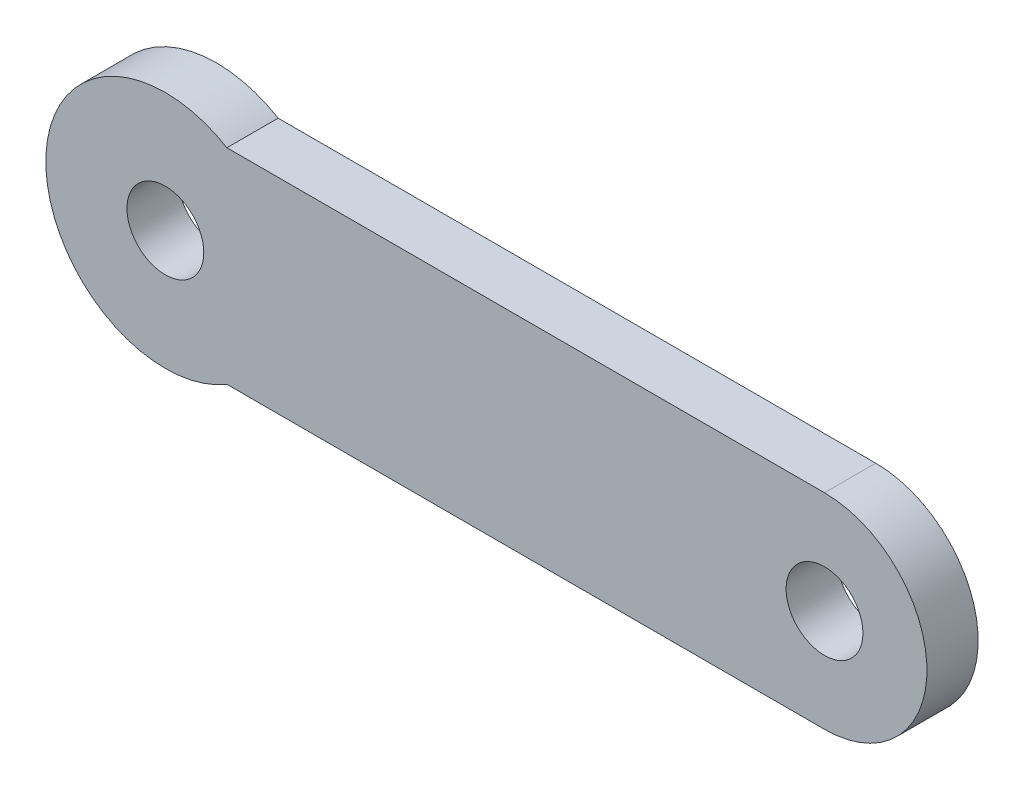
ISO-10303-21;
HEADER;
FILE_DESCRIPTION(('STEP AP214'),'2;1');
FILE_NAME('part.step','',(''),(''),'','','');
FILE_SCHEMA(('AUTOMOTIVE_DESIGN { 1 0 10303 214 1 1 1 1 }'));
ENDSEC;
DATA;
#1=APPLICATION_CONTEXT('core data for automotive mechanical design processes');
#2=APPLICATION_PROTOCOL_DEFINITION('international standard','automotive_design',2000,#1);
#3=PRODUCT_CONTEXT('',#1,'mechanical');
#4=PRODUCT('Part','Part','',(#3));
#5=PRODUCT_RELATED_PRODUCT_CATEGORY('part','',(#4));
#6=PRODUCT_DEFINITION_FORMATION('','',#4);
#7=PRODUCT_DEFINITION_CONTEXT('part definition',#1,'design');
#8=PRODUCT_DEFINITION('design','',#6,#7);
#9=PRODUCT_DEFINITION_SHAPE('','',#8);
#10=(LENGTH_UNIT() NAMED_UNIT(*) SI_UNIT(.MILLI.,.METRE.));
#11=(NAMED_UNIT(*) PLANE_ANGLE_UNIT() SI_UNIT($,.RADIAN.));
#12=(NAMED_UNIT(*) SI_UNIT($,.STERADIAN.) SOLID_ANGLE_UNIT());
#13=UNCERTAINTY_MEASURE_WITH_UNIT(LENGTH_MEASURE(1.E-05),#10,'distance_accuracy_value','');
#14=(GEOMETRIC_REPRESENTATION_CONTEXT(3) GLOBAL_UNCERTAINTY_ASSIGNED_CONTEXT((#13)) GLOBAL_UNIT_ASSIGNED_CONTEXT((#10,
#11,#12)) REPRESENTATION_CONTEXT('',''));
#15=CARTESIAN_POINT('',(0.,0.,0.));
#16=DIRECTION('',(0.,0.,1.));
#17=DIRECTION('',(1.,0.,0.));
#18=AXIS2_PLACEMENT_3D('',#15,#16,#17);
#19=CARTESIAN_POINT('',(0.,0.,3.));
#20=DIRECTION('',(0.,0.,1.));
#21=DIRECTION('',(1.,0.,0.));
#22=AXIS2_PLACEMENT_3D('',#19,#20,#21);
#23=PLANE('',#22);
#24=CARTESIAN_POINT('',(0.,0.,3.));
#25=DIRECTION('',(0.,0.,1.));
#26=DIRECTION('',(1.,0.,0.));
#27=AXIS2_PLACEMENT_3D('',#24,#25,#26);
#28=CIRCLE('',#27,2.25);
#29=CARTESIAN_POINT('',(2.25,0.,3.));
#30=VERTEX_POINT('',#29);
#31=EDGE_CURVE('E110',#30,#30,#28,.T.);
#32=ORIENTED_EDGE('',*,*,#31,.F.);
#33=EDGE_LOOP('',(#32));
#34=FACE_BOUND('',#33,.T.);
#35=CARTESIAN_POINT('',(0.,0.,3.));
#36=DIRECTION('',(0.,0.,1.));
#37=DIRECTION('',(1.,0.,0.));
#38=AXIS2_PLACEMENT_3D('',#35,#36,#37);
#39=CIRCLE('',#38,7.);
#40=CARTESIAN_POINT('',(3.60555127546399,6.,3.));
#41=VERTEX_POINT('',#40);
#42=CARTESIAN_POINT('',(3.60555127546399,-6.,3.));
#43=VERTEX_POINT('',#42);
#44=EDGE_CURVE('E95',#41,#43,#39,.T.);
#45=ORIENTED_EDGE('',*,*,#44,.T.);
#46=DIRECTION('',(1.,0.,0.));
#47=VECTOR('',#46,1.);
#48=CARTESIAN_POINT('',(3.60555127546399,-6.,3.));
#49=LINE('',#48,#47);
#50=CARTESIAN_POINT('',(38.605551275464,-6.,3.));
#51=VERTEX_POINT('',#50);
#52=EDGE_CURVE('E90',#43,#51,#49,.T.);
#53=ORIENTED_EDGE('',*,*,#52,.T.);
#54=CARTESIAN_POINT('',(38.605551275464,0.,3.));
#55=DIRECTION('',(0.,0.,1.));
#56=DIRECTION('',(-1.,0.,0.));
#57=AXIS2_PLACEMENT_3D('',#54,#55,#56);
#58=CIRCLE('',#57,6.);
#59=CARTESIAN_POINT('',(38.605551275464,6.,3.));
#60=VERTEX_POINT('',#59);
#61=EDGE_CURVE('E93',#51,#60,#58,.T.);
#62=ORIENTED_EDGE('',*,*,#61,.T.);
#63=DIRECTION('',(-1.,0.,0.));
#64=VECTOR('',#63,1.);
#65=CARTESIAN_POINT('',(3.60555127546399,6.,3.));
#66=LINE('',#65,#64);
#67=EDGE_CURVE('E60',#60,#41,#66,.T.);
#68=ORIENTED_EDGE('',*,*,#67,.T.);
#69=EDGE_LOOP('',(#45,#53,#62,#68));
#70=FACE_BOUND('',#69,.T.);
#71=CARTESIAN_POINT('',(38.605551275464,0.,3.));
#72=DIRECTION('',(0.,0.,1.));
#73=DIRECTION('',(1.,0.,0.));
#74=AXIS2_PLACEMENT_3D('',#71,#72,#73);
#75=CIRCLE('',#74,2.25);
#76=CARTESIAN_POINT('',(40.855551275464,0.,3.));
#77=VERTEX_POINT('',#76);
#78=EDGE_CURVE('E125',#77,#77,#75,.T.);
#79=ORIENTED_EDGE('',*,*,#78,.F.);
#80=EDGE_LOOP('',(#79));
#81=FACE_BOUND('',#80,.T.);
#82=ADVANCED_FACE('F43',(#34,#70,#81),#23,.T.);
#83=CARTESIAN_POINT('',(0.,0.,0.));
#84=DIRECTION('',(0.,0.,1.));
#85=DIRECTION('',(1.,0.,0.));
#86=AXIS2_PLACEMENT_3D('',#83,#84,#85);
#87=PLANE('',#86);
#88=CARTESIAN_POINT('',(0.,0.,0.));
#89=DIRECTION('',(0.,0.,1.));
#90=DIRECTION('',(1.,0.,0.));
#91=AXIS2_PLACEMENT_3D('',#88,#89,#90);
#92=CIRCLE('',#91,7.);
#93=CARTESIAN_POINT('',(3.60555127546399,6.,0.));
#94=VERTEX_POINT('',#93);
#95=CARTESIAN_POINT('',(3.60555127546399,-6.,0.));
#96=VERTEX_POINT('',#95);
#97=EDGE_CURVE('E107',#94,#96,#92,.T.);
#98=ORIENTED_EDGE('',*,*,#97,.F.);
#99=DIRECTION('',(-1.,0.,0.));
#100=VECTOR('',#99,1.);
#101=CARTESIAN_POINT('',(3.60555127546399,6.,0.));
#102=LINE('',#101,#100);
#103=CARTESIAN_POINT('',(38.605551275464,6.,0.));
#104=VERTEX_POINT('',#103);
#105=EDGE_CURVE('E83',#104,#94,#102,.T.);
#106=ORIENTED_EDGE('',*,*,#105,.F.);
#107=CARTESIAN_POINT('',(38.605551275464,0.,0.));
#108=DIRECTION('',(0.,0.,1.));
#109=DIRECTION('',(-1.,0.,0.));
#110=AXIS2_PLACEMENT_3D('',#107,#108,#109);
#111=CIRCLE('',#110,6.);
#112=CARTESIAN_POINT('',(38.605551275464,-6.,0.));
#113=VERTEX_POINT('',#112);
#114=EDGE_CURVE('E77',#113,#104,#111,.T.);
#115=ORIENTED_EDGE('',*,*,#114,.F.);
#116=DIRECTION('',(1.,0.,0.));
#117=VECTOR('',#116,1.);
#118=CARTESIAN_POINT('',(3.60555127546399,-6.,0.));
#119=LINE('',#118,#117);
#120=EDGE_CURVE('E99',#96,#113,#119,.T.);
#121=ORIENTED_EDGE('',*,*,#120,.F.);
#122=EDGE_LOOP('',(#98,#106,#115,#121));
#123=FACE_BOUND('',#122,.T.);
#124=CARTESIAN_POINT('',(0.,0.,0.));
#125=DIRECTION('',(0.,0.,1.));
#126=DIRECTION('',(1.,0.,0.));
#127=AXIS2_PLACEMENT_3D('',#124,#125,#126);
#128=CIRCLE('',#127,2.25);
#129=CARTESIAN_POINT('',(2.25,0.,0.));
#130=VERTEX_POINT('',#129);
#131=EDGE_CURVE('E122',#130,#130,#128,.T.);
#132=ORIENTED_EDGE('',*,*,#131,.T.);
#133=EDGE_LOOP('',(#132));
#134=FACE_BOUND('',#133,.T.);
#135=CARTESIAN_POINT('',(38.605551275464,0.,0.));
#136=DIRECTION('',(0.,0.,1.));
#137=DIRECTION('',(1.,0.,0.));
#138=AXIS2_PLACEMENT_3D('',#135,#136,#137);
#139=CIRCLE('',#138,2.25);
#140=CARTESIAN_POINT('',(40.855551275464,0.,0.));
#141=VERTEX_POINT('',#140);
#142=EDGE_CURVE('E128',#141,#141,#139,.T.);
#143=ORIENTED_EDGE('',*,*,#142,.T.);
#144=EDGE_LOOP('',(#143));
#145=FACE_BOUND('',#144,.T.);
#146=ADVANCED_FACE('F118',(#123,#134,#145),#87,.F.);
#147=CARTESIAN_POINT('',(0.,0.,3.));
#148=DIRECTION('',(0.,0.,-1.));
#149=DIRECTION('',(-1.,0.,0.));
#150=AXIS2_PLACEMENT_3D('',#147,#148,#149);
#151=CYLINDRICAL_SURFACE('',#150,7.);
#152=ORIENTED_EDGE('',*,*,#97,.T.);
#153=DIRECTION('',(0.,0.,-1.));
#154=VECTOR('',#153,1.);
#155=CARTESIAN_POINT('',(3.60555127546399,-6.,3.));
#156=LINE('',#155,#154);
#157=EDGE_CURVE('E11',#43,#96,#156,.T.);
#158=ORIENTED_EDGE('',*,*,#157,.F.);
#159=ORIENTED_EDGE('',*,*,#44,.F.);
#160=DIRECTION('',(0.,0.,-1.));
#161=VECTOR('',#160,1.);
#162=CARTESIAN_POINT('',(3.60555127546399,6.,3.));
#163=LINE('',#162,#161);
#164=EDGE_CURVE('E103',#41,#94,#163,.T.);
#165=ORIENTED_EDGE('',*,*,#164,.T.);
#166=EDGE_LOOP('',(#152,#158,#159,#165));
#167=FACE_BOUND('',#166,.T.);
#168=ADVANCED_FACE('F45',(#167),#151,.T.);
#169=CARTESIAN_POINT('',(3.60555127546399,-6.,3.));
#170=DIRECTION('',(0.,1.,0.));
#171=DIRECTION('',(0.,0.,1.));
#172=AXIS2_PLACEMENT_3D('',#169,#170,#171);
#173=PLANE('',#172);
#174=ORIENTED_EDGE('',*,*,#120,.T.);
#175=DIRECTION('',(0.,0.,-1.));
#176=VECTOR('',#175,1.);
#177=CARTESIAN_POINT('',(38.605551275464,-6.,3.));
#178=LINE('',#177,#176);
#179=EDGE_CURVE('E52',#51,#113,#178,.T.);
#180=ORIENTED_EDGE('',*,*,#179,.F.);
#181=ORIENTED_EDGE('',*,*,#52,.F.);
#182=ORIENTED_EDGE('',*,*,#157,.T.);
#183=EDGE_LOOP('',(#174,#180,#181,#182));
#184=FACE_BOUND('',#183,.T.);
#185=ADVANCED_FACE('F98',(#184),#173,.F.);
#186=CARTESIAN_POINT('',(38.605551275464,0.,3.));
#187=DIRECTION('',(0.,0.,-1.));
#188=DIRECTION('',(-1.,0.,0.));
#189=AXIS2_PLACEMENT_3D('',#186,#187,#188);
#190=CYLINDRICAL_SURFACE('',#189,6.);
#191=ORIENTED_EDGE('',*,*,#114,.T.);
#192=DIRECTION('',(0.,0.,-1.));
#193=VECTOR('',#192,1.);
#194=CARTESIAN_POINT('',(38.605551275464,6.,3.));
#195=LINE('',#194,#193);
#196=EDGE_CURVE('E100',#60,#104,#195,.T.);
#197=ORIENTED_EDGE('',*,*,#196,.F.);
#198=ORIENTED_EDGE('',*,*,#61,.F.);
#199=ORIENTED_EDGE('',*,*,#179,.T.);
#200=EDGE_LOOP('',(#191,#197,#198,#199));
#201=FACE_BOUND('',#200,.T.);
#202=ADVANCED_FACE('F101',(#201),#190,.T.);
#203=CARTESIAN_POINT('',(3.60555127546399,6.,3.));
#204=DIRECTION('',(0.,-1.,0.));
#205=DIRECTION('',(0.,0.,-1.));
#206=AXIS2_PLACEMENT_3D('',#203,#204,#205);
#207=PLANE('',#206);
#208=ORIENTED_EDGE('',*,*,#105,.T.);
#209=ORIENTED_EDGE('',*,*,#164,.F.);
#210=ORIENTED_EDGE('',*,*,#67,.F.);
#211=ORIENTED_EDGE('',*,*,#196,.T.);
#212=EDGE_LOOP('',(#208,#209,#210,#211));
#213=FACE_BOUND('',#212,.T.);
#214=ADVANCED_FACE('F115',(#213),#207,.F.);
#215=CARTESIAN_POINT('',(0.,0.,3.));
#216=DIRECTION('',(0.,0.,-1.));
#217=DIRECTION('',(-1.,0.,0.));
#218=AXIS2_PLACEMENT_3D('',#215,#216,#217);
#219=CYLINDRICAL_SURFACE('',#218,2.25);
#220=ORIENTED_EDGE('',*,*,#31,.T.);
#221=EDGE_LOOP('',(#220));
#222=FACE_BOUND('',#221,.T.);
#223=ORIENTED_EDGE('',*,*,#131,.F.);
#224=EDGE_LOOP('',(#223));
#225=FACE_BOUND('',#224,.T.);
#226=ADVANCED_FACE('F145',(#222,#225),#219,.F.);
#227=CARTESIAN_POINT('',(38.605551275464,0.,3.));
#228=DIRECTION('',(0.,0.,-1.));
#229=DIRECTION('',(-1.,0.,0.));
#230=AXIS2_PLACEMENT_3D('',#227,#228,#229);
#231=CYLINDRICAL_SURFACE('',#230,2.25);
#232=ORIENTED_EDGE('',*,*,#78,.T.);
#233=EDGE_LOOP('',(#232));
#234=FACE_BOUND('',#233,.T.);
#235=ORIENTED_EDGE('',*,*,#142,.F.);
#236=EDGE_LOOP('',(#235));
#237=FACE_BOUND('',#236,.T.);
#238=ADVANCED_FACE('F134',(#234,#237),#231,.F.);
#239=CLOSED_SHELL('',(#82,#146,#168,#185,#202,#214,#226,#238));
#240=MANIFOLD_SOLID_BREP('B2',#239);
#241=ADVANCED_BREP_SHAPE_REPRESENTATION('',(#18,#240),#14);
#242=SHAPE_DEFINITION_REPRESENTATION(#9,#241);
ENDSEC;
END-ISO-10303-21;
